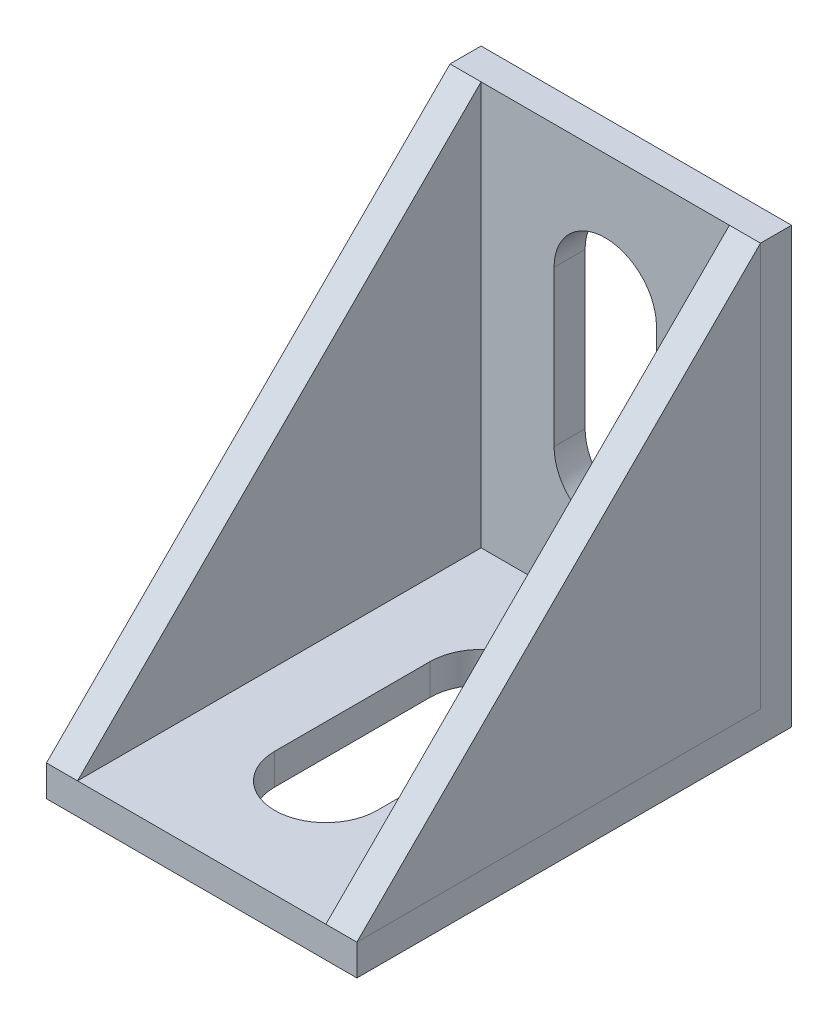
ISO-10303-21;
HEADER;
FILE_DESCRIPTION(('STEP AP214'),'2;1');
FILE_NAME('part.step','',(''),(''),'','','');
FILE_SCHEMA(('AUTOMOTIVE_DESIGN { 1 0 10303 214 1 1 1 1 }'));
ENDSEC;
DATA;
#1=APPLICATION_CONTEXT('core data for automotive mechanical design processes');
#2=APPLICATION_PROTOCOL_DEFINITION('international standard','automotive_design',2000,#1);
#3=PRODUCT_CONTEXT('',#1,'mechanical');
#4=PRODUCT('Part','Part','',(#3));
#5=PRODUCT_RELATED_PRODUCT_CATEGORY('part','',(#4));
#6=PRODUCT_DEFINITION_FORMATION('','',#4);
#7=PRODUCT_DEFINITION_CONTEXT('part definition',#1,'design');
#8=PRODUCT_DEFINITION('design','',#6,#7);
#9=PRODUCT_DEFINITION_SHAPE('','',#8);
#10=(LENGTH_UNIT() NAMED_UNIT(*) SI_UNIT(.MILLI.,.METRE.));
#11=(NAMED_UNIT(*) PLANE_ANGLE_UNIT() SI_UNIT($,.RADIAN.));
#12=(NAMED_UNIT(*) SI_UNIT($,.STERADIAN.) SOLID_ANGLE_UNIT());
#13=UNCERTAINTY_MEASURE_WITH_UNIT(LENGTH_MEASURE(1.E-05),#10,'distance_accuracy_value','');
#14=(GEOMETRIC_REPRESENTATION_CONTEXT(3) GLOBAL_UNCERTAINTY_ASSIGNED_CONTEXT((#13)) GLOBAL_UNIT_ASSIGNED_CONTEXT((#10,
#11,#12)) REPRESENTATION_CONTEXT('',''));
#15=CARTESIAN_POINT('',(0.,0.,0.));
#16=DIRECTION('',(0.,0.,1.));
#17=DIRECTION('',(1.,0.,0.));
#18=AXIS2_PLACEMENT_3D('',#15,#16,#17);
#19=CARTESIAN_POINT('',(2.,-4.91932298674868,23.5378021333965));
#20=DIRECTION('',(0.,-0.707106781186547,-0.707106781186547));
#21=DIRECTION('',(0.,0.707106781186548,-0.707106781186548));
#22=AXIS2_PLACEMENT_3D('',#19,#20,#21);
#23=PLANE('',#22);
#24=DIRECTION('',(0.,-0.707106781186548,0.707106781186548));
#25=VECTOR('',#24,1.);
#26=CARTESIAN_POINT('',(0.,-4.91932298674868,23.5378021333965));
#27=LINE('',#26,#25);
#28=CARTESIAN_POINT('',(0.,21.0806770132513,-2.46219786660349));
#29=VERTEX_POINT('',#28);
#30=CARTESIAN_POINT('',(0.,-4.91932298674868,23.5378021333965));
#31=VERTEX_POINT('',#30);
#32=EDGE_CURVE('E94',#29,#31,#27,.T.);
#33=ORIENTED_EDGE('',*,*,#32,.T.);
#34=DIRECTION('',(-1.,0.,0.));
#35=VECTOR('',#34,1.);
#36=CARTESIAN_POINT('',(2.,-4.91932298674868,23.5378021333965));
#37=LINE('',#36,#35);
#38=CARTESIAN_POINT('',(2.,-4.91932298674868,23.5378021333965));
#39=VERTEX_POINT('',#38);
#40=EDGE_CURVE('E12',#39,#31,#37,.T.);
#41=ORIENTED_EDGE('',*,*,#40,.F.);
#42=DIRECTION('',(0.,-0.707106781186548,0.707106781186548));
#43=VECTOR('',#42,1.);
#44=CARTESIAN_POINT('',(2.,-4.91932298674868,23.5378021333965));
#45=LINE('',#44,#43);
#46=CARTESIAN_POINT('',(2.,21.0806770132513,-2.46219786660349));
#47=VERTEX_POINT('',#46);
#48=EDGE_CURVE('E87',#47,#39,#45,.T.);
#49=ORIENTED_EDGE('',*,*,#48,.F.);
#50=DIRECTION('',(-1.,0.,0.));
#51=VECTOR('',#50,1.);
#52=CARTESIAN_POINT('',(2.,21.0806770132513,-2.46219786660349));
#53=LINE('',#52,#51);
#54=EDGE_CURVE('E95',#47,#29,#53,.T.);
#55=ORIENTED_EDGE('',*,*,#54,.T.);
#56=EDGE_LOOP('',(#33,#41,#49,#55));
#57=FACE_BOUND('',#56,.T.);
#58=ADVANCED_FACE('F47',(#57),#23,.F.);
#59=CARTESIAN_POINT('',(2.,-4.91932298674868,-2.46219786660349));
#60=DIRECTION('',(0.,1.,0.));
#61=DIRECTION('',(0.,0.,1.));
#62=AXIS2_PLACEMENT_3D('',#59,#60,#61);
#63=PLANE('',#62);
#64=DIRECTION('',(0.,0.,-1.));
#65=VECTOR('',#64,1.);
#66=CARTESIAN_POINT('',(0.,-4.91932298674868,-2.46219786660349));
#67=LINE('',#66,#65);
#68=CARTESIAN_POINT('',(0.,-4.91932298674868,-2.46219786660349));
#69=VERTEX_POINT('',#68);
#70=EDGE_CURVE('E75',#31,#69,#67,.T.);
#71=ORIENTED_EDGE('',*,*,#70,.T.);
#72=DIRECTION('',(-1.,0.,0.));
#73=VECTOR('',#72,1.);
#74=CARTESIAN_POINT('',(2.,-4.91932298674868,-2.46219786660349));
#75=LINE('',#74,#73);
#76=CARTESIAN_POINT('',(2.,-4.91932298674868,-2.46219786660349));
#77=VERTEX_POINT('',#76);
#78=EDGE_CURVE('E55',#77,#69,#75,.T.);
#79=ORIENTED_EDGE('',*,*,#78,.F.);
#80=DIRECTION('',(0.,0.,-1.));
#81=VECTOR('',#80,1.);
#82=CARTESIAN_POINT('',(2.,-4.91932298674868,-2.46219786660349));
#83=LINE('',#82,#81);
#84=EDGE_CURVE('E83',#39,#77,#83,.T.);
#85=ORIENTED_EDGE('',*,*,#84,.F.);
#86=ORIENTED_EDGE('',*,*,#40,.T.);
#87=EDGE_LOOP('',(#71,#79,#85,#86));
#88=FACE_BOUND('',#87,.T.);
#89=ADVANCED_FACE('F84',(#88),#63,.F.);
#90=CARTESIAN_POINT('',(2.,-4.91932298674868,-2.46219786660349));
#91=DIRECTION('',(0.,0.,1.));
#92=DIRECTION('',(1.,0.,0.));
#93=AXIS2_PLACEMENT_3D('',#90,#91,#92);
#94=PLANE('',#93);
#95=DIRECTION('',(0.,1.,0.));
#96=VECTOR('',#95,1.);
#97=CARTESIAN_POINT('',(0.,-4.91932298674868,-2.46219786660349));
#98=LINE('',#97,#96);
#99=EDGE_CURVE('E80',#69,#29,#98,.T.);
#100=ORIENTED_EDGE('',*,*,#99,.T.);
#101=ORIENTED_EDGE('',*,*,#54,.F.);
#102=DIRECTION('',(0.,1.,0.));
#103=VECTOR('',#102,1.);
#104=CARTESIAN_POINT('',(2.,-4.91932298674868,-2.46219786660349));
#105=LINE('',#104,#103);
#106=EDGE_CURVE('E63',#77,#47,#105,.T.);
#107=ORIENTED_EDGE('',*,*,#106,.F.);
#108=ORIENTED_EDGE('',*,*,#78,.T.);
#109=EDGE_LOOP('',(#100,#101,#107,#108));
#110=FACE_BOUND('',#109,.T.);
#111=ADVANCED_FACE('F102',(#110),#94,.F.);
#112=CARTESIAN_POINT('',(2.,0.,0.));
#113=DIRECTION('',(1.,0.,0.));
#114=DIRECTION('',(0.,0.,-1.));
#115=AXIS2_PLACEMENT_3D('',#112,#113,#114);
#116=PLANE('',#115);
#117=ORIENTED_EDGE('',*,*,#48,.T.);
#118=ORIENTED_EDGE('',*,*,#84,.T.);
#119=ORIENTED_EDGE('',*,*,#106,.T.);
#120=EDGE_LOOP('',(#117,#118,#119));
#121=FACE_BOUND('',#120,.T.);
#122=ADVANCED_FACE('F90',(#121),#116,.T.);
#123=CARTESIAN_POINT('',(0.,0.,0.));
#124=DIRECTION('',(1.,0.,0.));
#125=DIRECTION('',(0.,0.,-1.));
#126=AXIS2_PLACEMENT_3D('',#123,#124,#125);
#127=PLANE('',#126);
#128=ORIENTED_EDGE('',*,*,#32,.F.);
#129=ORIENTED_EDGE('',*,*,#99,.F.);
#130=ORIENTED_EDGE('',*,*,#70,.F.);
#131=EDGE_LOOP('',(#128,#129,#130));
#132=FACE_BOUND('',#131,.T.);
#133=ADVANCED_FACE('F103',(#132),#127,.F.);
#134=CLOSED_SHELL('',(#58,#89,#111,#122,#133));
#135=MANIFOLD_SOLID_BREP('B2',#134);
#136=CARTESIAN_POINT('',(18.,21.0806770132513,-2.46219786660349));
#137=DIRECTION('',(0.,-0.707106781186548,-0.707106781186547));
#138=DIRECTION('',(0.,0.707106781186547,-0.707106781186548));
#139=AXIS2_PLACEMENT_3D('',#136,#137,#138);
#140=PLANE('',#139);
#141=DIRECTION('',(0.,0.707106781186547,-0.707106781186548));
#142=VECTOR('',#141,1.);
#143=CARTESIAN_POINT('',(20.,21.0806770132513,-2.46219786660349));
#144=LINE('',#143,#142);
#145=CARTESIAN_POINT('',(20.,-4.91932298674868,23.5378021333965));
#146=VERTEX_POINT('',#145);
#147=CARTESIAN_POINT('',(20.,21.0806770132513,-2.46219786660349));
#148=VERTEX_POINT('',#147);
#149=EDGE_CURVE('E201',#146,#148,#144,.T.);
#150=ORIENTED_EDGE('',*,*,#149,.T.);
#151=DIRECTION('',(1.,0.,0.));
#152=VECTOR('',#151,1.);
#153=CARTESIAN_POINT('',(18.,21.0806770132513,-2.46219786660349));
#154=LINE('',#153,#152);
#155=CARTESIAN_POINT('',(18.,21.0806770132513,-2.46219786660349));
#156=VERTEX_POINT('',#155);
#157=EDGE_CURVE('E45',#156,#148,#154,.T.);
#158=ORIENTED_EDGE('',*,*,#157,.F.);
#159=DIRECTION('',(0.,0.707106781186547,-0.707106781186548));
#160=VECTOR('',#159,1.);
#161=CARTESIAN_POINT('',(18.,21.0806770132513,-2.46219786660349));
#162=LINE('',#161,#160);
#163=CARTESIAN_POINT('',(18.,-4.91932298674868,23.5378021333965));
#164=VERTEX_POINT('',#163);
#165=EDGE_CURVE('E194',#164,#156,#162,.T.);
#166=ORIENTED_EDGE('',*,*,#165,.F.);
#167=DIRECTION('',(1.,0.,0.));
#168=VECTOR('',#167,1.);
#169=CARTESIAN_POINT('',(18.,-4.91932298674868,23.5378021333965));
#170=LINE('',#169,#168);
#171=EDGE_CURVE('E202',#164,#146,#170,.T.);
#172=ORIENTED_EDGE('',*,*,#171,.T.);
#173=EDGE_LOOP('',(#150,#158,#166,#172));
#174=FACE_BOUND('',#173,.T.);
#175=ADVANCED_FACE('F154',(#174),#140,.F.);
#176=CARTESIAN_POINT('',(18.,-4.91932298674868,-2.46219786660349));
#177=DIRECTION('',(0.,0.,1.));
#178=DIRECTION('',(1.,0.,0.));
#179=AXIS2_PLACEMENT_3D('',#176,#177,#178);
#180=PLANE('',#179);
#181=DIRECTION('',(0.,-1.,0.));
#182=VECTOR('',#181,1.);
#183=CARTESIAN_POINT('',(20.,-4.91932298674868,-2.46219786660349));
#184=LINE('',#183,#182);
#185=CARTESIAN_POINT('',(20.,-4.91932298674868,-2.46219786660349));
#186=VERTEX_POINT('',#185);
#187=EDGE_CURVE('E182',#148,#186,#184,.T.);
#188=ORIENTED_EDGE('',*,*,#187,.T.);
#189=DIRECTION('',(1.,0.,0.));
#190=VECTOR('',#189,1.);
#191=CARTESIAN_POINT('',(18.,-4.91932298674868,-2.46219786660349));
#192=LINE('',#191,#190);
#193=CARTESIAN_POINT('',(18.,-4.91932298674868,-2.46219786660349));
#194=VERTEX_POINT('',#193);
#195=EDGE_CURVE('E162',#194,#186,#192,.T.);
#196=ORIENTED_EDGE('',*,*,#195,.F.);
#197=DIRECTION('',(0.,-1.,0.));
#198=VECTOR('',#197,1.);
#199=CARTESIAN_POINT('',(18.,-4.91932298674868,-2.46219786660349));
#200=LINE('',#199,#198);
#201=EDGE_CURVE('E190',#156,#194,#200,.T.);
#202=ORIENTED_EDGE('',*,*,#201,.F.);
#203=ORIENTED_EDGE('',*,*,#157,.T.);
#204=EDGE_LOOP('',(#188,#196,#202,#203));
#205=FACE_BOUND('',#204,.T.);
#206=ADVANCED_FACE('F191',(#205),#180,.F.);
#207=CARTESIAN_POINT('',(18.,-4.91932298674868,-2.46219786660349));
#208=DIRECTION('',(0.,1.,0.));
#209=DIRECTION('',(0.,0.,1.));
#210=AXIS2_PLACEMENT_3D('',#207,#208,#209);
#211=PLANE('',#210);
#212=DIRECTION('',(0.,0.,1.));
#213=VECTOR('',#212,1.);
#214=CARTESIAN_POINT('',(20.,-4.91932298674868,-2.46219786660349));
#215=LINE('',#214,#213);
#216=EDGE_CURVE('E187',#186,#146,#215,.T.);
#217=ORIENTED_EDGE('',*,*,#216,.T.);
#218=ORIENTED_EDGE('',*,*,#171,.F.);
#219=DIRECTION('',(0.,0.,1.));
#220=VECTOR('',#219,1.);
#221=CARTESIAN_POINT('',(18.,-4.91932298674868,-2.46219786660349));
#222=LINE('',#221,#220);
#223=EDGE_CURVE('E170',#194,#164,#222,.T.);
#224=ORIENTED_EDGE('',*,*,#223,.F.);
#225=ORIENTED_EDGE('',*,*,#195,.T.);
#226=EDGE_LOOP('',(#217,#218,#224,#225));
#227=FACE_BOUND('',#226,.T.);
#228=ADVANCED_FACE('F209',(#227),#211,.F.);
#229=CARTESIAN_POINT('',(18.,0.,0.));
#230=DIRECTION('',(-1.,0.,0.));
#231=DIRECTION('',(0.,0.,1.));
#232=AXIS2_PLACEMENT_3D('',#229,#230,#231);
#233=PLANE('',#232);
#234=ORIENTED_EDGE('',*,*,#165,.T.);
#235=ORIENTED_EDGE('',*,*,#201,.T.);
#236=ORIENTED_EDGE('',*,*,#223,.T.);
#237=EDGE_LOOP('',(#234,#235,#236));
#238=FACE_BOUND('',#237,.T.);
#239=ADVANCED_FACE('F197',(#238),#233,.T.);
#240=CARTESIAN_POINT('',(20.,0.,0.));
#241=DIRECTION('',(-1.,0.,0.));
#242=DIRECTION('',(0.,0.,1.));
#243=AXIS2_PLACEMENT_3D('',#240,#241,#242);
#244=PLANE('',#243);
#245=ORIENTED_EDGE('',*,*,#149,.F.);
#246=ORIENTED_EDGE('',*,*,#216,.F.);
#247=ORIENTED_EDGE('',*,*,#187,.F.);
#248=EDGE_LOOP('',(#245,#246,#247));
#249=FACE_BOUND('',#248,.T.);
#250=ADVANCED_FACE('F210',(#249),#244,.F.);
#251=CLOSED_SHELL('',(#175,#206,#228,#239,#250));
#252=MANIFOLD_SOLID_BREP('B6',#251);
#253=CARTESIAN_POINT('',(20.,21.0806770132513,-2.46219786660349));
#254=DIRECTION('',(0.,0.,-1.));
#255=DIRECTION('',(-1.,0.,0.));
#256=AXIS2_PLACEMENT_3D('',#253,#254,#255);
#257=PLANE('',#256);
#258=DIRECTION('',(0.,-1.,0.));
#259=VECTOR('',#258,1.);
#260=CARTESIAN_POINT('',(0.,21.0806770132513,-2.46219786660349));
#261=LINE('',#260,#259);
#262=CARTESIAN_POINT('',(0.,21.0806770132513,-2.46219786660349));
#263=VERTEX_POINT('',#262);
#264=CARTESIAN_POINT('',(0.,-4.91932298674868,-2.46219786660349));
#265=VERTEX_POINT('',#264);
#266=EDGE_CURVE('E407',#263,#265,#261,.T.);
#267=ORIENTED_EDGE('',*,*,#266,.T.);
#268=DIRECTION('',(-1.,0.,0.));
#269=VECTOR('',#268,1.);
#270=CARTESIAN_POINT('',(20.,-4.91932298674868,-2.46219786660349));
#271=LINE('',#270,#269);
#272=CARTESIAN_POINT('',(20.,-4.91932298674868,-2.46219786660349));
#273=VERTEX_POINT('',#272);
#274=EDGE_CURVE('E382',#273,#265,#271,.T.);
#275=ORIENTED_EDGE('',*,*,#274,.F.);
#276=DIRECTION('',(0.,-1.,0.));
#277=VECTOR('',#276,1.);
#278=CARTESIAN_POINT('',(20.,21.0806770132513,-2.46219786660349));
#279=LINE('',#278,#277);
#280=CARTESIAN_POINT('',(20.,21.0806770132513,-2.46219786660349));
#281=VERTEX_POINT('',#280);
#282=EDGE_CURVE('E420',#281,#273,#279,.T.);
#283=ORIENTED_EDGE('',*,*,#282,.F.);
#284=DIRECTION('',(-1.,0.,0.));
#285=VECTOR('',#284,1.);
#286=CARTESIAN_POINT('',(20.,21.0806770132513,-2.46219786660349));
#287=LINE('',#286,#285);
#288=EDGE_CURVE('E379',#281,#263,#287,.T.);
#289=ORIENTED_EDGE('',*,*,#288,.T.);
#290=EDGE_LOOP('',(#267,#275,#283,#289));
#291=FACE_BOUND('',#290,.T.);
#292=CARTESIAN_POINT('',(10.,13.0806770132513,-2.46219786660349));
#293=DIRECTION('',(0.,0.,-1.));
#294=DIRECTION('',(-1.,0.,0.));
#295=AXIS2_PLACEMENT_3D('',#292,#293,#294);
#296=CIRCLE('',#295,3.29999999999997);
#297=CARTESIAN_POINT('',(13.3,13.0806770132513,-2.46219786660349));
#298=VERTEX_POINT('',#297);
#299=CARTESIAN_POINT('',(6.70000000000003,13.0806770132513,-2.46219786660349));
#300=VERTEX_POINT('',#299);
#301=EDGE_CURVE('E443',#298,#300,#296,.F.);
#302=ORIENTED_EDGE('',*,*,#301,.F.);
#303=DIRECTION('',(0.,1.,0.));
#304=VECTOR('',#303,1.);
#305=CARTESIAN_POINT('',(13.3,21.0806770132513,-2.46219786660349));
#306=LINE('',#305,#304);
#307=CARTESIAN_POINT('',(13.3,3.08067701325132,-2.46219786660349));
#308=VERTEX_POINT('',#307);
#309=EDGE_CURVE('E448',#308,#298,#306,.T.);
#310=ORIENTED_EDGE('',*,*,#309,.F.);
#311=CARTESIAN_POINT('',(10.,3.08067701325132,-2.46219786660349));
#312=DIRECTION('',(0.,0.,-1.));
#313=DIRECTION('',(-1.,0.,0.));
#314=AXIS2_PLACEMENT_3D('',#311,#312,#313);
#315=CIRCLE('',#314,3.29999999999997);
#316=CARTESIAN_POINT('',(6.70000000000003,3.08067701325132,-2.46219786660349));
#317=VERTEX_POINT('',#316);
#318=EDGE_CURVE('E363',#317,#308,#315,.F.);
#319=ORIENTED_EDGE('',*,*,#318,.F.);
#320=DIRECTION('',(0.,-1.,0.));
#321=VECTOR('',#320,1.);
#322=CARTESIAN_POINT('',(6.70000000000003,21.0806770132513,-2.46219786660349));
#323=LINE('',#322,#321);
#324=EDGE_CURVE('E445',#300,#317,#323,.T.);
#325=ORIENTED_EDGE('',*,*,#324,.F.);
#326=EDGE_LOOP('',(#302,#310,#319,#325));
#327=FACE_BOUND('',#326,.T.);
#328=ADVANCED_FACE('F253',(#291,#327),#257,.F.);
#329=CARTESIAN_POINT('',(20.,21.0806770132513,-4.46219786660349));
#330=DIRECTION('',(0.,0.,1.));
#331=DIRECTION('',(0.,-1.,0.));
#332=AXIS2_PLACEMENT_3D('',#329,#330,#331);
#333=PLANE('',#332);
#334=DIRECTION('',(0.,1.,0.));
#335=VECTOR('',#334,1.);
#336=CARTESIAN_POINT('',(0.,21.0806770132513,-4.46219786660349));
#337=LINE('',#336,#335);
#338=CARTESIAN_POINT('',(0.,-6.91932298674867,-4.46219786660349));
#339=VERTEX_POINT('',#338);
#340=CARTESIAN_POINT('',(0.,21.0806770132513,-4.46219786660349));
#341=VERTEX_POINT('',#340);
#342=EDGE_CURVE('E398',#339,#341,#337,.T.);
#343=ORIENTED_EDGE('',*,*,#342,.T.);
#344=DIRECTION('',(-1.,0.,0.));
#345=VECTOR('',#344,1.);
#346=CARTESIAN_POINT('',(20.,21.0806770132513,-4.46219786660349));
#347=LINE('',#346,#345);
#348=CARTESIAN_POINT('',(20.,21.0806770132513,-4.46219786660349));
#349=VERTEX_POINT('',#348);
#350=EDGE_CURVE('E394',#349,#341,#347,.T.);
#351=ORIENTED_EDGE('',*,*,#350,.F.);
#352=DIRECTION('',(0.,1.,0.));
#353=VECTOR('',#352,1.);
#354=CARTESIAN_POINT('',(20.,21.0806770132513,-4.46219786660349));
#355=LINE('',#354,#353);
#356=CARTESIAN_POINT('',(20.,-6.91932298674867,-4.46219786660349));
#357=VERTEX_POINT('',#356);
#358=EDGE_CURVE('E397',#357,#349,#355,.T.);
#359=ORIENTED_EDGE('',*,*,#358,.F.);
#360=DIRECTION('',(-1.,0.,0.));
#361=VECTOR('',#360,1.);
#362=CARTESIAN_POINT('',(20.,-6.91932298674867,-4.46219786660349));
#363=LINE('',#362,#361);
#364=EDGE_CURVE('E391',#357,#339,#363,.T.);
#365=ORIENTED_EDGE('',*,*,#364,.T.);
#366=EDGE_LOOP('',(#343,#351,#359,#365));
#367=FACE_BOUND('',#366,.T.);
#368=CARTESIAN_POINT('',(10.,13.0806770132513,-4.46219786660349));
#369=DIRECTION('',(0.,0.,1.));
#370=DIRECTION('',(0.,-1.,0.));
#371=AXIS2_PLACEMENT_3D('',#368,#369,#370);
#372=CIRCLE('',#371,3.29999999999997);
#373=CARTESIAN_POINT('',(6.70000000000003,13.0806770132513,-4.46219786660349));
#374=VERTEX_POINT('',#373);
#375=CARTESIAN_POINT('',(13.3,13.0806770132513,-4.46219786660349));
#376=VERTEX_POINT('',#375);
#377=EDGE_CURVE('E152',#374,#376,#372,.F.);
#378=ORIENTED_EDGE('',*,*,#377,.F.);
#379=DIRECTION('',(0.,1.,0.));
#380=VECTOR('',#379,1.);
#381=CARTESIAN_POINT('',(6.70000000000003,21.0806770132513,-4.46219786660349));
#382=LINE('',#381,#380);
#383=CARTESIAN_POINT('',(6.70000000000003,3.08067701325132,-4.46219786660349));
#384=VERTEX_POINT('',#383);
#385=EDGE_CURVE('E261',#384,#374,#382,.T.);
#386=ORIENTED_EDGE('',*,*,#385,.F.);
#387=CARTESIAN_POINT('',(10.,3.08067701325132,-4.46219786660349));
#388=DIRECTION('',(0.,0.,1.));
#389=DIRECTION('',(0.,-1.,0.));
#390=AXIS2_PLACEMENT_3D('',#387,#388,#389);
#391=CIRCLE('',#390,3.29999999999997);
#392=CARTESIAN_POINT('',(13.3,3.08067701325132,-4.46219786660349));
#393=VERTEX_POINT('',#392);
#394=EDGE_CURVE('E355',#393,#384,#391,.F.);
#395=ORIENTED_EDGE('',*,*,#394,.F.);
#396=DIRECTION('',(0.,-1.,0.));
#397=VECTOR('',#396,1.);
#398=CARTESIAN_POINT('',(13.3,21.0806770132513,-4.46219786660349));
#399=LINE('',#398,#397);
#400=EDGE_CURVE('E350',#376,#393,#399,.T.);
#401=ORIENTED_EDGE('',*,*,#400,.F.);
#402=EDGE_LOOP('',(#378,#386,#395,#401));
#403=FACE_BOUND('',#402,.T.);
#404=ADVANCED_FACE('F368',(#367,#403),#333,.F.);
#405=CARTESIAN_POINT('',(20.,-4.91932298674868,-2.46219786660349));
#406=DIRECTION('',(0.,-1.,0.));
#407=DIRECTION('',(0.,0.,-1.));
#408=AXIS2_PLACEMENT_3D('',#405,#406,#407);
#409=PLANE('',#408);
#410=DIRECTION('',(0.,0.,1.));
#411=VECTOR('',#410,1.);
#412=CARTESIAN_POINT('',(0.,-4.91932298674868,-2.46219786660349));
#413=LINE('',#412,#411);
#414=CARTESIAN_POINT('',(0.,-4.91932298674868,23.5378021333965));
#415=VERTEX_POINT('',#414);
#416=EDGE_CURVE('E405',#265,#415,#413,.T.);
#417=ORIENTED_EDGE('',*,*,#416,.T.);
#418=DIRECTION('',(-1.,0.,0.));
#419=VECTOR('',#418,1.);
#420=CARTESIAN_POINT('',(20.,-4.91932298674868,23.5378021333965));
#421=LINE('',#420,#419);
#422=CARTESIAN_POINT('',(20.,-4.91932298674868,23.5378021333965));
#423=VERTEX_POINT('',#422);
#424=EDGE_CURVE('E385',#423,#415,#421,.T.);
#425=ORIENTED_EDGE('',*,*,#424,.F.);
#426=DIRECTION('',(0.,0.,1.));
#427=VECTOR('',#426,1.);
#428=CARTESIAN_POINT('',(20.,-4.91932298674868,-2.46219786660349));
#429=LINE('',#428,#427);
#430=EDGE_CURVE('E418',#273,#423,#429,.T.);
#431=ORIENTED_EDGE('',*,*,#430,.F.);
#432=ORIENTED_EDGE('',*,*,#274,.T.);
#433=EDGE_LOOP('',(#417,#425,#431,#432));
#434=FACE_BOUND('',#433,.T.);
#435=CARTESIAN_POINT('',(10.,-4.91932298674868,5.53780213339651));
#436=DIRECTION('',(0.,-1.,0.));
#437=DIRECTION('',(0.,0.,-1.));
#438=AXIS2_PLACEMENT_3D('',#435,#436,#437);
#439=CIRCLE('',#438,3.3);
#440=CARTESIAN_POINT('',(13.3,-4.91932298674868,5.53780213339651));
#441=VERTEX_POINT('',#440);
#442=CARTESIAN_POINT('',(6.7,-4.91932298674868,5.53780213339651));
#443=VERTEX_POINT('',#442);
#444=EDGE_CURVE('E412',#441,#443,#439,.F.);
#445=ORIENTED_EDGE('',*,*,#444,.F.);
#446=DIRECTION('',(0.,0.,-1.));
#447=VECTOR('',#446,1.);
#448=CARTESIAN_POINT('',(13.3,-4.91932298674868,-2.46219786660349));
#449=LINE('',#448,#447);
#450=CARTESIAN_POINT('',(13.3,-4.91932298674868,15.5378021333965));
#451=VERTEX_POINT('',#450);
#452=EDGE_CURVE('E430',#451,#441,#449,.T.);
#453=ORIENTED_EDGE('',*,*,#452,.F.);
#454=CARTESIAN_POINT('',(10.,-4.91932298674868,15.5378021333965));
#455=DIRECTION('',(0.,-1.,0.));
#456=DIRECTION('',(0.,0.,-1.));
#457=AXIS2_PLACEMENT_3D('',#454,#455,#456);
#458=CIRCLE('',#457,3.3);
#459=CARTESIAN_POINT('',(6.7,-4.91932298674868,15.5378021333965));
#460=VERTEX_POINT('',#459);
#461=EDGE_CURVE('E427',#460,#451,#458,.F.);
#462=ORIENTED_EDGE('',*,*,#461,.F.);
#463=DIRECTION('',(0.,0.,1.));
#464=VECTOR('',#463,1.);
#465=CARTESIAN_POINT('',(6.7,-4.91932298674868,-2.46219786660349));
#466=LINE('',#465,#464);
#467=EDGE_CURVE('E425',#443,#460,#466,.T.);
#468=ORIENTED_EDGE('',*,*,#467,.F.);
#469=EDGE_LOOP('',(#445,#453,#462,#468));
#470=FACE_BOUND('',#469,.T.);
#471=ADVANCED_FACE('F478',(#434,#470),#409,.F.);
#472=CARTESIAN_POINT('',(20.,-6.91932298674867,-4.46219786660349));
#473=DIRECTION('',(0.,1.,0.));
#474=DIRECTION('',(0.,0.,1.));
#475=AXIS2_PLACEMENT_3D('',#472,#473,#474);
#476=PLANE('',#475);
#477=DIRECTION('',(0.,0.,-1.));
#478=VECTOR('',#477,1.);
#479=CARTESIAN_POINT('',(0.,-6.91932298674867,-4.46219786660349));
#480=LINE('',#479,#478);
#481=CARTESIAN_POINT('',(0.,-6.91932298674868,23.5378021333965));
#482=VERTEX_POINT('',#481);
#483=EDGE_CURVE('E401',#482,#339,#480,.T.);
#484=ORIENTED_EDGE('',*,*,#483,.T.);
#485=ORIENTED_EDGE('',*,*,#364,.F.);
#486=DIRECTION('',(0.,0.,-1.));
#487=VECTOR('',#486,1.);
#488=CARTESIAN_POINT('',(20.,-6.91932298674867,-4.46219786660349));
#489=LINE('',#488,#487);
#490=CARTESIAN_POINT('',(20.,-6.91932298674868,23.5378021333965));
#491=VERTEX_POINT('',#490);
#492=EDGE_CURVE('E414',#491,#357,#489,.T.);
#493=ORIENTED_EDGE('',*,*,#492,.F.);
#494=DIRECTION('',(-1.,0.,0.));
#495=VECTOR('',#494,1.);
#496=CARTESIAN_POINT('',(20.,-6.91932298674868,23.5378021333965));
#497=LINE('',#496,#495);
#498=EDGE_CURVE('E388',#491,#482,#497,.T.);
#499=ORIENTED_EDGE('',*,*,#498,.T.);
#500=EDGE_LOOP('',(#484,#485,#493,#499));
#501=FACE_BOUND('',#500,.T.);
#502=CARTESIAN_POINT('',(10.,-6.91932298674868,5.53780213339651));
#503=DIRECTION('',(0.,1.,0.));
#504=DIRECTION('',(0.,0.,1.));
#505=AXIS2_PLACEMENT_3D('',#502,#503,#504);
#506=CIRCLE('',#505,3.3);
#507=CARTESIAN_POINT('',(6.7,-6.91932298674868,5.53780213339651));
#508=VERTEX_POINT('',#507);
#509=CARTESIAN_POINT('',(13.3,-6.91932298674867,5.53780213339651));
#510=VERTEX_POINT('',#509);
#511=EDGE_CURVE('E356',#508,#510,#506,.F.);
#512=ORIENTED_EDGE('',*,*,#511,.F.);
#513=DIRECTION('',(0.,0.,-1.));
#514=VECTOR('',#513,1.);
#515=CARTESIAN_POINT('',(6.7,-6.91932298674867,-4.46219786660349));
#516=LINE('',#515,#514);
#517=CARTESIAN_POINT('',(6.7,-6.91932298674868,15.5378021333965));
#518=VERTEX_POINT('',#517);
#519=EDGE_CURVE('E373',#518,#508,#516,.T.);
#520=ORIENTED_EDGE('',*,*,#519,.F.);
#521=CARTESIAN_POINT('',(10.,-6.91932298674868,15.5378021333965));
#522=DIRECTION('',(0.,1.,0.));
#523=DIRECTION('',(0.,0.,1.));
#524=AXIS2_PLACEMENT_3D('',#521,#522,#523);
#525=CIRCLE('',#524,3.3);
#526=CARTESIAN_POINT('',(13.3,-6.91932298674868,15.5378021333965));
#527=VERTEX_POINT('',#526);
#528=EDGE_CURVE('E375',#527,#518,#525,.F.);
#529=ORIENTED_EDGE('',*,*,#528,.F.);
#530=DIRECTION('',(0.,0.,1.));
#531=VECTOR('',#530,1.);
#532=CARTESIAN_POINT('',(13.3,-6.91932298674867,-4.46219786660349));
#533=LINE('',#532,#531);
#534=EDGE_CURVE('E377',#510,#527,#533,.T.);
#535=ORIENTED_EDGE('',*,*,#534,.F.);
#536=EDGE_LOOP('',(#512,#520,#529,#535));
#537=FACE_BOUND('',#536,.T.);
#538=ADVANCED_FACE('F484',(#501,#537),#476,.F.);
#539=CARTESIAN_POINT('',(20.,21.0806770132513,-4.46219786660349));
#540=DIRECTION('',(0.,-1.,0.));
#541=DIRECTION('',(0.,0.,-1.));
#542=AXIS2_PLACEMENT_3D('',#539,#540,#541);
#543=PLANE('',#542);
#544=DIRECTION('',(0.,0.,1.));
#545=VECTOR('',#544,1.);
#546=CARTESIAN_POINT('',(0.,21.0806770132513,-4.46219786660349));
#547=LINE('',#546,#545);
#548=EDGE_CURVE('E409',#341,#263,#547,.T.);
#549=ORIENTED_EDGE('',*,*,#548,.T.);
#550=ORIENTED_EDGE('',*,*,#288,.F.);
#551=DIRECTION('',(0.,0.,1.));
#552=VECTOR('',#551,1.);
#553=CARTESIAN_POINT('',(20.,21.0806770132513,-4.46219786660349));
#554=LINE('',#553,#552);
#555=EDGE_CURVE('E400',#349,#281,#554,.T.);
#556=ORIENTED_EDGE('',*,*,#555,.F.);
#557=ORIENTED_EDGE('',*,*,#350,.T.);
#558=EDGE_LOOP('',(#549,#550,#556,#557));
#559=FACE_BOUND('',#558,.T.);
#560=ADVANCED_FACE('F255',(#559),#543,.F.);
#561=CARTESIAN_POINT('',(20.,-6.91932298674868,23.5378021333965));
#562=DIRECTION('',(0.,0.,-1.));
#563=DIRECTION('',(-1.,0.,0.));
#564=AXIS2_PLACEMENT_3D('',#561,#562,#563);
#565=PLANE('',#564);
#566=DIRECTION('',(0.,-1.,0.));
#567=VECTOR('',#566,1.);
#568=CARTESIAN_POINT('',(0.,-6.91932298674868,23.5378021333965));
#569=LINE('',#568,#567);
#570=EDGE_CURVE('E403',#415,#482,#569,.T.);
#571=ORIENTED_EDGE('',*,*,#570,.T.);
#572=ORIENTED_EDGE('',*,*,#498,.F.);
#573=DIRECTION('',(0.,-1.,0.));
#574=VECTOR('',#573,1.);
#575=CARTESIAN_POINT('',(20.,-6.91932298674868,23.5378021333965));
#576=LINE('',#575,#574);
#577=EDGE_CURVE('E416',#423,#491,#576,.T.);
#578=ORIENTED_EDGE('',*,*,#577,.F.);
#579=ORIENTED_EDGE('',*,*,#424,.T.);
#580=EDGE_LOOP('',(#571,#572,#578,#579));
#581=FACE_BOUND('',#580,.T.);
#582=ADVANCED_FACE('F486',(#581),#565,.F.);
#583=CARTESIAN_POINT('',(20.,0.,0.));
#584=DIRECTION('',(1.,0.,0.));
#585=DIRECTION('',(0.,0.,-1.));
#586=AXIS2_PLACEMENT_3D('',#583,#584,#585);
#587=PLANE('',#586);
#588=ORIENTED_EDGE('',*,*,#555,.T.);
#589=ORIENTED_EDGE('',*,*,#282,.T.);
#590=ORIENTED_EDGE('',*,*,#430,.T.);
#591=ORIENTED_EDGE('',*,*,#577,.T.);
#592=ORIENTED_EDGE('',*,*,#492,.T.);
#593=ORIENTED_EDGE('',*,*,#358,.T.);
#594=EDGE_LOOP('',(#588,#589,#590,#591,#592,#593));
#595=FACE_BOUND('',#594,.T.);
#596=ADVANCED_FACE('F489',(#595),#587,.T.);
#597=CARTESIAN_POINT('',(0.,0.,0.));
#598=DIRECTION('',(1.,0.,0.));
#599=DIRECTION('',(0.,0.,-1.));
#600=AXIS2_PLACEMENT_3D('',#597,#598,#599);
#601=PLANE('',#600);
#602=ORIENTED_EDGE('',*,*,#548,.F.);
#603=ORIENTED_EDGE('',*,*,#342,.F.);
#604=ORIENTED_EDGE('',*,*,#483,.F.);
#605=ORIENTED_EDGE('',*,*,#570,.F.);
#606=ORIENTED_EDGE('',*,*,#416,.F.);
#607=ORIENTED_EDGE('',*,*,#266,.F.);
#608=EDGE_LOOP('',(#602,#603,#604,#605,#606,#607));
#609=FACE_BOUND('',#608,.T.);
#610=ADVANCED_FACE('F494',(#609),#601,.F.);
#611=CARTESIAN_POINT('',(10.,1.08067701325132,5.53780213339651));
#612=DIRECTION('',(0.,-1.,0.));
#613=DIRECTION('',(0.,0.,-1.));
#614=AXIS2_PLACEMENT_3D('',#611,#612,#613);
#615=CYLINDRICAL_SURFACE('',#614,3.3);
#616=ORIENTED_EDGE('',*,*,#444,.T.);
#617=DIRECTION('',(0.,-1.,0.));
#618=VECTOR('',#617,1.);
#619=CARTESIAN_POINT('',(6.7,1.08067701325132,5.53780213339651));
#620=LINE('',#619,#618);
#621=EDGE_CURVE('E432',#443,#508,#620,.T.);
#622=ORIENTED_EDGE('',*,*,#621,.T.);
#623=ORIENTED_EDGE('',*,*,#511,.T.);
#624=DIRECTION('',(0.,-1.,0.));
#625=VECTOR('',#624,1.);
#626=CARTESIAN_POINT('',(13.3,1.08067701325132,5.53780213339651));
#627=LINE('',#626,#625);
#628=EDGE_CURVE('E441',#441,#510,#627,.T.);
#629=ORIENTED_EDGE('',*,*,#628,.F.);
#630=EDGE_LOOP('',(#616,#622,#623,#629));
#631=FACE_BOUND('',#630,.T.);
#632=ADVANCED_FACE('F497',(#631),#615,.F.);
#633=CARTESIAN_POINT('',(6.7,1.08067701325132,15.5378021333965));
#634=DIRECTION('',(1.,0.,0.));
#635=DIRECTION('',(0.,0.,-1.));
#636=AXIS2_PLACEMENT_3D('',#633,#634,#635);
#637=PLANE('',#636);
#638=ORIENTED_EDGE('',*,*,#467,.T.);
#639=DIRECTION('',(0.,-1.,0.));
#640=VECTOR('',#639,1.);
#641=CARTESIAN_POINT('',(6.7,1.08067701325132,15.5378021333965));
#642=LINE('',#641,#640);
#643=EDGE_CURVE('E435',#460,#518,#642,.T.);
#644=ORIENTED_EDGE('',*,*,#643,.T.);
#645=ORIENTED_EDGE('',*,*,#519,.T.);
#646=ORIENTED_EDGE('',*,*,#621,.F.);
#647=EDGE_LOOP('',(#638,#644,#645,#646));
#648=FACE_BOUND('',#647,.T.);
#649=ADVANCED_FACE('F504',(#648),#637,.T.);
#650=CARTESIAN_POINT('',(10.,1.08067701325132,15.5378021333965));
#651=DIRECTION('',(0.,-1.,0.));
#652=DIRECTION('',(0.,0.,-1.));
#653=AXIS2_PLACEMENT_3D('',#650,#651,#652);
#654=CYLINDRICAL_SURFACE('',#653,3.3);
#655=ORIENTED_EDGE('',*,*,#461,.T.);
#656=DIRECTION('',(0.,-1.,0.));
#657=VECTOR('',#656,1.);
#658=CARTESIAN_POINT('',(13.3,1.08067701325132,15.5378021333965));
#659=LINE('',#658,#657);
#660=EDGE_CURVE('E438',#451,#527,#659,.T.);
#661=ORIENTED_EDGE('',*,*,#660,.T.);
#662=ORIENTED_EDGE('',*,*,#528,.T.);
#663=ORIENTED_EDGE('',*,*,#643,.F.);
#664=EDGE_LOOP('',(#655,#661,#662,#663));
#665=FACE_BOUND('',#664,.T.);
#666=ADVANCED_FACE('F470',(#665),#654,.F.);
#667=CARTESIAN_POINT('',(13.3,1.08067701325132,15.5378021333965));
#668=DIRECTION('',(-1.,0.,0.));
#669=DIRECTION('',(0.,0.,1.));
#670=AXIS2_PLACEMENT_3D('',#667,#668,#669);
#671=PLANE('',#670);
#672=ORIENTED_EDGE('',*,*,#452,.T.);
#673=ORIENTED_EDGE('',*,*,#628,.T.);
#674=ORIENTED_EDGE('',*,*,#534,.T.);
#675=ORIENTED_EDGE('',*,*,#660,.F.);
#676=EDGE_LOOP('',(#672,#673,#674,#675));
#677=FACE_BOUND('',#676,.T.);
#678=ADVANCED_FACE('F463',(#677),#671,.T.);
#679=CARTESIAN_POINT('',(10.,13.0806770132513,2.53780213339651));
#680=DIRECTION('',(0.,0.,-1.));
#681=DIRECTION('',(-1.,0.,0.));
#682=AXIS2_PLACEMENT_3D('',#679,#680,#681);
#683=CYLINDRICAL_SURFACE('',#682,3.29999999999997);
#684=ORIENTED_EDGE('',*,*,#301,.T.);
#685=DIRECTION('',(0.,0.,-1.));
#686=VECTOR('',#685,1.);
#687=CARTESIAN_POINT('',(6.70000000000003,13.0806770132513,2.53780213339651));
#688=LINE('',#687,#686);
#689=EDGE_CURVE('E450',#300,#374,#688,.T.);
#690=ORIENTED_EDGE('',*,*,#689,.T.);
#691=ORIENTED_EDGE('',*,*,#377,.T.);
#692=DIRECTION('',(0.,0.,-1.));
#693=VECTOR('',#692,1.);
#694=CARTESIAN_POINT('',(13.3,13.0806770132513,2.53780213339651));
#695=LINE('',#694,#693);
#696=EDGE_CURVE('E273',#298,#376,#695,.T.);
#697=ORIENTED_EDGE('',*,*,#696,.F.);
#698=EDGE_LOOP('',(#684,#690,#691,#697));
#699=FACE_BOUND('',#698,.T.);
#700=ADVANCED_FACE('F461',(#699),#683,.F.);
#701=CARTESIAN_POINT('',(6.70000000000003,3.08067701325132,2.53780213339651));
#702=DIRECTION('',(1.,0.,0.));
#703=DIRECTION('',(0.,0.,-1.));
#704=AXIS2_PLACEMENT_3D('',#701,#702,#703);
#705=PLANE('',#704);
#706=ORIENTED_EDGE('',*,*,#324,.T.);
#707=DIRECTION('',(0.,0.,-1.));
#708=VECTOR('',#707,1.);
#709=CARTESIAN_POINT('',(6.70000000000003,3.08067701325132,2.53780213339651));
#710=LINE('',#709,#708);
#711=EDGE_CURVE('E365',#317,#384,#710,.T.);
#712=ORIENTED_EDGE('',*,*,#711,.T.);
#713=ORIENTED_EDGE('',*,*,#385,.T.);
#714=ORIENTED_EDGE('',*,*,#689,.F.);
#715=EDGE_LOOP('',(#706,#712,#713,#714));
#716=FACE_BOUND('',#715,.T.);
#717=ADVANCED_FACE('F455',(#716),#705,.T.);
#718=CARTESIAN_POINT('',(10.,3.08067701325132,2.53780213339651));
#719=DIRECTION('',(0.,0.,-1.));
#720=DIRECTION('',(-1.,0.,0.));
#721=AXIS2_PLACEMENT_3D('',#718,#719,#720);
#722=CYLINDRICAL_SURFACE('',#721,3.29999999999997);
#723=ORIENTED_EDGE('',*,*,#318,.T.);
#724=DIRECTION('',(0.,0.,-1.));
#725=VECTOR('',#724,1.);
#726=CARTESIAN_POINT('',(13.3,3.08067701325132,2.53780213339651));
#727=LINE('',#726,#725);
#728=EDGE_CURVE('E268',#308,#393,#727,.T.);
#729=ORIENTED_EDGE('',*,*,#728,.T.);
#730=ORIENTED_EDGE('',*,*,#394,.T.);
#731=ORIENTED_EDGE('',*,*,#711,.F.);
#732=EDGE_LOOP('',(#723,#729,#730,#731));
#733=FACE_BOUND('',#732,.T.);
#734=ADVANCED_FACE('F359',(#733),#722,.F.);
#735=CARTESIAN_POINT('',(13.3,3.08067701325132,2.53780213339651));
#736=DIRECTION('',(-1.,0.,0.));
#737=DIRECTION('',(0.,0.,1.));
#738=AXIS2_PLACEMENT_3D('',#735,#736,#737);
#739=PLANE('',#738);
#740=ORIENTED_EDGE('',*,*,#309,.T.);
#741=ORIENTED_EDGE('',*,*,#696,.T.);
#742=ORIENTED_EDGE('',*,*,#400,.T.);
#743=ORIENTED_EDGE('',*,*,#728,.F.);
#744=EDGE_LOOP('',(#740,#741,#742,#743));
#745=FACE_BOUND('',#744,.T.);
#746=ADVANCED_FACE('F351',(#745),#739,.T.);
#747=CLOSED_SHELL('',(#328,#404,#471,#538,#560,#582,#596,#610,#632,#649,#666,#678,#700,#717,
#734,#746));
#748=MANIFOLD_SOLID_BREP('B39',#747);
#749=ADVANCED_BREP_SHAPE_REPRESENTATION('',(#18,#135,#252,#748),#14);
#750=SHAPE_DEFINITION_REPRESENTATION(#9,#749);
ENDSEC;
END-ISO-10303-21;
